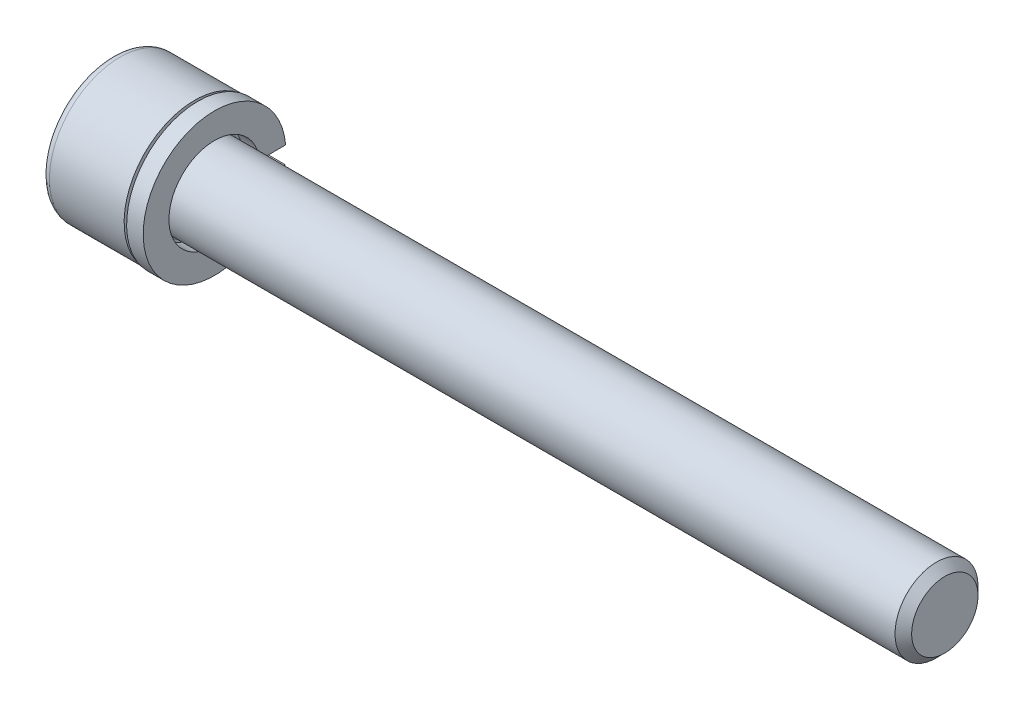
ISO-10303-21;
HEADER;
FILE_DESCRIPTION(('STEP AP214'),'2;1');
FILE_NAME('part.step','',(''),(''),'','','');
FILE_SCHEMA(('AUTOMOTIVE_DESIGN { 1 0 10303 214 1 1 1 1 }'));
ENDSEC;
DATA;
#1=APPLICATION_CONTEXT('core data for automotive mechanical design processes');
#2=APPLICATION_PROTOCOL_DEFINITION('international standard','automotive_design',2000,#1);
#3=PRODUCT_CONTEXT('',#1,'mechanical');
#4=PRODUCT('Part','Part','',(#3));
#5=PRODUCT_RELATED_PRODUCT_CATEGORY('part','',(#4));
#6=PRODUCT_DEFINITION_FORMATION('','',#4);
#7=PRODUCT_DEFINITION_CONTEXT('part definition',#1,'design');
#8=PRODUCT_DEFINITION('design','',#6,#7);
#9=PRODUCT_DEFINITION_SHAPE('','',#8);
#10=(LENGTH_UNIT() NAMED_UNIT(*) SI_UNIT(.MILLI.,.METRE.));
#11=(NAMED_UNIT(*) PLANE_ANGLE_UNIT() SI_UNIT($,.RADIAN.));
#12=(NAMED_UNIT(*) SI_UNIT($,.STERADIAN.) SOLID_ANGLE_UNIT());
#13=UNCERTAINTY_MEASURE_WITH_UNIT(LENGTH_MEASURE(1.E-05),#10,'distance_accuracy_value','');
#14=(GEOMETRIC_REPRESENTATION_CONTEXT(3) GLOBAL_UNCERTAINTY_ASSIGNED_CONTEXT((#13)) GLOBAL_UNIT_ASSIGNED_CONTEXT((#10,
#11,#12)) REPRESENTATION_CONTEXT('',''));
#15=CARTESIAN_POINT('',(0.,0.,0.));
#16=DIRECTION('',(0.,0.,1.));
#17=DIRECTION('',(1.,0.,0.));
#18=AXIS2_PLACEMENT_3D('',#15,#16,#17);
#19=CARTESIAN_POINT('',(1.2,0.,0.));
#20=DIRECTION('',(1.,0.,0.));
#21=DIRECTION('',(0.,1.,0.));
#22=AXIS2_PLACEMENT_3D('',#19,#20,#21);
#23=PLANE('',#22);
#24=CARTESIAN_POINT('',(1.2,0.,0.));
#25=DIRECTION('',(-1.,0.,0.));
#26=DIRECTION('',(0.,-1.,0.));
#27=AXIS2_PLACEMENT_3D('',#24,#25,#26);
#28=CIRCLE('',#27,2.75);
#29=CARTESIAN_POINT('',(1.2,-0.63593269228035,-2.67546063527182));
#30=VERTEX_POINT('',#29);
#31=CARTESIAN_POINT('',(1.2,0.374431043820241,-2.72439009567714));
#32=VERTEX_POINT('',#31);
#33=EDGE_CURVE('P0_E19',#30,#32,#28,.T.);
#34=ORIENTED_EDGE('',*,*,#33,.T.);
#35=DIRECTION('',(0.,0.,1.));
#36=VECTOR('',#35,1.);
#37=CARTESIAN_POINT('',(1.2,0.374431043820241,-2.72439009567714));
#38=LINE('',#37,#36);
#39=CARTESIAN_POINT('',(1.2,0.374431043820242,-4.28366681634131));
#40=VERTEX_POINT('',#39);
#41=EDGE_CURVE('P0_E62',#32,#40,#38,.F.);
#42=ORIENTED_EDGE('',*,*,#41,.T.);
#43=CARTESIAN_POINT('',(1.2,0.,0.));
#44=DIRECTION('',(-1.,0.,0.));
#45=DIRECTION('',(0.,-1.,0.));
#46=AXIS2_PLACEMENT_3D('',#43,#44,#45);
#47=CIRCLE('',#46,4.3);
#48=CARTESIAN_POINT('',(1.2,-0.63593269228035,-4.25271555725152));
#49=VERTEX_POINT('',#48);
#50=EDGE_CURVE('P0_E57',#49,#40,#47,.T.);
#51=ORIENTED_EDGE('',*,*,#50,.F.);
#52=DIRECTION('',(0.,0.,1.));
#53=VECTOR('',#52,1.);
#54=CARTESIAN_POINT('',(1.2,-0.63593269228035,-2.67546063527182));
#55=LINE('',#54,#53);
#56=EDGE_CURVE('P0_E59',#49,#30,#55,.T.);
#57=ORIENTED_EDGE('',*,*,#56,.T.);
#58=EDGE_LOOP('',(#34,#42,#51,#57));
#59=FACE_BOUND('',#58,.T.);
#60=ADVANCED_FACE('P0_F16',(#59),#23,.T.);
#61=CARTESIAN_POINT('',(1.2,-0.63593269228035,-2.67546063527182));
#62=DIRECTION('',(0.,-1.,0.));
#63=DIRECTION('',(1.,0.,0.));
#64=AXIS2_PLACEMENT_3D('',#61,#62,#63);
#65=PLANE('',#64);
#66=DIRECTION('',(-1.,0.,0.));
#67=VECTOR('',#66,1.);
#68=CARTESIAN_POINT('',(1.2,-0.63593269228035,-2.67546063527182));
#69=LINE('',#68,#67);
#70=CARTESIAN_POINT('',(0.2,-0.63593269228035,-2.67546063527182));
#71=VERTEX_POINT('',#70);
#72=EDGE_CURVE('P0_E72',#71,#30,#69,.F.);
#73=ORIENTED_EDGE('',*,*,#72,.T.);
#74=ORIENTED_EDGE('',*,*,#56,.F.);
#75=DIRECTION('',(1.,0.,0.));
#76=VECTOR('',#75,1.);
#77=CARTESIAN_POINT('',(1.2,-0.63593269228035,-4.25271555725152));
#78=LINE('',#77,#76);
#79=CARTESIAN_POINT('',(0.2,-0.63593269228035,-4.25271555725152));
#80=VERTEX_POINT('',#79);
#81=EDGE_CURVE('P0_E71',#80,#49,#78,.T.);
#82=ORIENTED_EDGE('',*,*,#81,.F.);
#83=DIRECTION('',(0.,0.,1.));
#84=VECTOR('',#83,1.);
#85=CARTESIAN_POINT('',(0.2,-0.63593269228035,0.));
#86=LINE('',#85,#84);
#87=EDGE_CURVE('P0_E82',#80,#71,#86,.T.);
#88=ORIENTED_EDGE('',*,*,#87,.T.);
#89=EDGE_LOOP('',(#73,#74,#82,#88));
#90=FACE_BOUND('',#89,.T.);
#91=ADVANCED_FACE('P0_F69',(#90),#65,.F.);
#92=CARTESIAN_POINT('',(1.2,0.,0.));
#93=DIRECTION('',(-1.,0.,0.));
#94=DIRECTION('',(0.,-1.,0.));
#95=AXIS2_PLACEMENT_3D('',#92,#93,#94);
#96=CYLINDRICAL_SURFACE('',#95,2.75);
#97=ORIENTED_EDGE('',*,*,#33,.F.);
#98=ORIENTED_EDGE('',*,*,#72,.F.);
#99=CARTESIAN_POINT('',(0.2,0.,0.));
#100=DIRECTION('',(-1.,0.,0.));
#101=DIRECTION('',(0.,-1.,0.));
#102=AXIS2_PLACEMENT_3D('',#99,#100,#101);
#103=CIRCLE('',#102,2.75);
#104=CARTESIAN_POINT('',(0.2,0.374431043820241,-2.72439009567714));
#105=VERTEX_POINT('',#104);
#106=EDGE_CURVE('P0_E25',#71,#105,#103,.T.);
#107=ORIENTED_EDGE('',*,*,#106,.T.);
#108=DIRECTION('',(-1.,0.,0.));
#109=VECTOR('',#108,1.);
#110=CARTESIAN_POINT('',(1.2,0.374431043820241,-2.72439009567714));
#111=LINE('',#110,#109);
#112=EDGE_CURVE('P0_E79',#105,#32,#111,.F.);
#113=ORIENTED_EDGE('',*,*,#112,.T.);
#114=EDGE_LOOP('',(#97,#98,#107,#113));
#115=FACE_BOUND('',#114,.T.);
#116=ADVANCED_FACE('P0_F90',(#115),#96,.F.);
#117=CARTESIAN_POINT('',(1.2,0.374431043820241,-2.72439009567714));
#118=DIRECTION('',(0.,1.,0.));
#119=DIRECTION('',(-1.,0.,0.));
#120=AXIS2_PLACEMENT_3D('',#117,#118,#119);
#121=PLANE('',#120);
#122=DIRECTION('',(-1.,0.,0.));
#123=VECTOR('',#122,1.);
#124=CARTESIAN_POINT('',(1.2,0.374431043820242,-4.28366681634131));
#125=LINE('',#124,#123);
#126=CARTESIAN_POINT('',(0.2,0.374431043820241,-4.28366681634131));
#127=VERTEX_POINT('',#126);
#128=EDGE_CURVE('P0_E66',#40,#127,#125,.T.);
#129=ORIENTED_EDGE('',*,*,#128,.F.);
#130=ORIENTED_EDGE('',*,*,#41,.F.);
#131=ORIENTED_EDGE('',*,*,#112,.F.);
#132=DIRECTION('',(0.,0.,1.));
#133=VECTOR('',#132,1.);
#134=CARTESIAN_POINT('',(0.2,0.37443104382024,0.));
#135=LINE('',#134,#133);
#136=EDGE_CURVE('P0_E11',#105,#127,#135,.F.);
#137=ORIENTED_EDGE('',*,*,#136,.T.);
#138=EDGE_LOOP('',(#129,#130,#131,#137));
#139=FACE_BOUND('',#138,.T.);
#140=ADVANCED_FACE('P0_F87',(#139),#121,.F.);
#141=CARTESIAN_POINT('',(1.2,0.,0.));
#142=DIRECTION('',(-1.,0.,0.));
#143=DIRECTION('',(0.,-1.,0.));
#144=AXIS2_PLACEMENT_3D('',#141,#142,#143);
#145=CYLINDRICAL_SURFACE('',#144,4.3);
#146=ORIENTED_EDGE('',*,*,#128,.T.);
#147=CARTESIAN_POINT('',(0.2,0.,0.));
#148=DIRECTION('',(-1.,0.,0.));
#149=DIRECTION('',(0.,-1.,0.));
#150=AXIS2_PLACEMENT_3D('',#147,#148,#149);
#151=CIRCLE('',#150,4.3);
#152=EDGE_CURVE('P0_E34',#127,#80,#151,.F.);
#153=ORIENTED_EDGE('',*,*,#152,.T.);
#154=ORIENTED_EDGE('',*,*,#81,.T.);
#155=ORIENTED_EDGE('',*,*,#50,.T.);
#156=EDGE_LOOP('',(#146,#153,#154,#155));
#157=FACE_BOUND('',#156,.T.);
#158=ADVANCED_FACE('P0_F74',(#157),#145,.T.);
#159=CARTESIAN_POINT('',(0.2,0.,0.));
#160=DIRECTION('',(1.,0.,0.));
#161=DIRECTION('',(0.,1.,0.));
#162=AXIS2_PLACEMENT_3D('',#159,#160,#161);
#163=PLANE('',#162);
#164=ORIENTED_EDGE('',*,*,#136,.F.);
#165=ORIENTED_EDGE('',*,*,#106,.F.);
#166=ORIENTED_EDGE('',*,*,#87,.F.);
#167=ORIENTED_EDGE('',*,*,#152,.F.);
#168=EDGE_LOOP('',(#164,#165,#166,#167));
#169=FACE_BOUND('',#168,.T.);
#170=ADVANCED_FACE('P0_F89',(#169),#163,.F.);
#171=CLOSED_SHELL('',(#60,#91,#116,#140,#158,#170));
#172=MANIFOLD_SOLID_BREP('P0_B1',#171);
#173=CARTESIAN_POINT('',(-2.49999999994088,0.,0.));
#174=DIRECTION('',(-1.,0.,0.));
#175=DIRECTION('',(0.,-1.,0.));
#176=AXIS2_PLACEMENT_3D('',#173,#174,#175);
#177=CONICAL_SURFACE('',#176,2.2914999999557,1.04719755113381);
#178=CARTESIAN_POINT('',(-1.17700185805347,-1.70530256582424E-10,0.));
#179=VERTEX_POINT('',#178);
#180=VERTEX_LOOP('',#179);
#181=FACE_BOUND('',#180,.T.);
#182=CARTESIAN_POINT('',(-2.50000000000652,0.,0.));
#183=DIRECTION('',(-1.,0.,0.));
#184=DIRECTION('',(0.,-1.,0.));
#185=AXIS2_PLACEMENT_3D('',#182,#183,#184);
#186=CIRCLE('',#185,2.29150000006939);
#187=CARTESIAN_POINT('',(-2.50000000000652,-1.14575000003469,-1.98449721283214));
#188=VERTEX_POINT('',#187);
#189=CARTESIAN_POINT('',(-2.50000000000652,-2.29150000006939,0.));
#190=VERTEX_POINT('',#189);
#191=EDGE_CURVE('P1_E88',#188,#190,#186,.T.);
#192=ORIENTED_EDGE('',*,*,#191,.T.);
#193=CARTESIAN_POINT('',(-2.49999999994088,0.,0.));
#194=DIRECTION('',(-1.,0.,0.));
#195=DIRECTION('',(0.,-1.,0.));
#196=AXIS2_PLACEMENT_3D('',#193,#194,#195);
#197=CIRCLE('',#196,2.2914999999557);
#198=CARTESIAN_POINT('',(-2.49999999994088,-1.14574999997785,1.98449721273368));
#199=VERTEX_POINT('',#198);
#200=EDGE_CURVE('P1_E83',#190,#199,#197,.T.);
#201=ORIENTED_EDGE('',*,*,#200,.T.);
#202=CARTESIAN_POINT('',(-2.49999999994088,0.,0.));
#203=DIRECTION('',(-1.,0.,0.));
#204=DIRECTION('',(0.,-1.,0.));
#205=AXIS2_PLACEMENT_3D('',#202,#203,#204);
#206=CIRCLE('',#205,2.2914999999557);
#207=CARTESIAN_POINT('',(-2.49999999994088,1.14574999997785,1.98449721273368));
#208=VERTEX_POINT('',#207);
#209=EDGE_CURVE('P1_E85',#199,#208,#206,.T.);
#210=ORIENTED_EDGE('',*,*,#209,.T.);
#211=CARTESIAN_POINT('',(-2.49999999994088,0.,0.));
#212=DIRECTION('',(-1.,0.,0.));
#213=DIRECTION('',(0.,-1.,0.));
#214=AXIS2_PLACEMENT_3D('',#211,#212,#213);
#215=CIRCLE('',#214,2.2914999999557);
#216=CARTESIAN_POINT('',(-2.49999999998408,2.2915000000173,2.46963907657438E-11));
#217=VERTEX_POINT('',#216);
#218=EDGE_CURVE('P1_E99',#208,#217,#215,.T.);
#219=ORIENTED_EDGE('',*,*,#218,.T.);
#220=CARTESIAN_POINT('',(-2.49999999994088,0.,0.));
#221=DIRECTION('',(-1.,0.,0.));
#222=DIRECTION('',(0.,-1.,0.));
#223=AXIS2_PLACEMENT_3D('',#220,#221,#222);
#224=CIRCLE('',#223,2.2914999999557);
#225=CARTESIAN_POINT('',(-2.49999999994088,1.14574999997785,-1.98449721273368));
#226=VERTEX_POINT('',#225);
#227=EDGE_CURVE('P1_E186',#217,#226,#224,.T.);
#228=ORIENTED_EDGE('',*,*,#227,.T.);
#229=CARTESIAN_POINT('',(-2.49999999994088,0.,0.));
#230=DIRECTION('',(-1.,0.,0.));
#231=DIRECTION('',(0.,-1.,0.));
#232=AXIS2_PLACEMENT_3D('',#229,#230,#231);
#233=CIRCLE('',#232,2.2914999999557);
#234=EDGE_CURVE('P1_E184',#226,#188,#233,.T.);
#235=ORIENTED_EDGE('',*,*,#234,.T.);
#236=EDGE_LOOP('',(#192,#201,#210,#219,#228,#235));
#237=FACE_BOUND('',#236,.T.);
#238=ADVANCED_FACE('P1_F16',(#181,#237),#177,.F.);
#239=CARTESIAN_POINT('',(-2.5,0.,0.));
#240=DIRECTION('',(-1.,0.,0.));
#241=DIRECTION('',(0.,-1.,0.));
#242=AXIS2_PLACEMENT_3D('',#239,#240,#241);
#243=PLANE('',#242);
#244=ORIENTED_EDGE('',*,*,#209,.F.);
#245=DIRECTION('',(0.,-1.,0.));
#246=VECTOR('',#245,1.);
#247=CARTESIAN_POINT('',(-2.5,-1.14575,1.98449721277204));
#248=LINE('',#247,#246);
#249=EDGE_CURVE('P1_E93',#199,#208,#248,.F.);
#250=ORIENTED_EDGE('',*,*,#249,.T.);
#251=EDGE_LOOP('',(#244,#250));
#252=FACE_BOUND('',#251,.T.);
#253=ADVANCED_FACE('P1_F96',(#252),#243,.F.);
#254=CARTESIAN_POINT('',(-2.5,0.,0.));
#255=DIRECTION('',(-1.,0.,0.));
#256=DIRECTION('',(0.,-1.,0.));
#257=AXIS2_PLACEMENT_3D('',#254,#255,#256);
#258=PLANE('',#257);
#259=ORIENTED_EDGE('',*,*,#218,.F.);
#260=DIRECTION('',(0.,-0.5,0.866025403784439));
#261=VECTOR('',#260,1.);
#262=CARTESIAN_POINT('',(-2.5,1.14575,1.98449721277204));
#263=LINE('',#262,#261);
#264=EDGE_CURVE('P1_E162',#208,#217,#263,.F.);
#265=ORIENTED_EDGE('',*,*,#264,.T.);
#266=EDGE_LOOP('',(#259,#265));
#267=FACE_BOUND('',#266,.T.);
#268=ADVANCED_FACE('P1_F293',(#267),#258,.F.);
#269=CARTESIAN_POINT('',(-2.5,0.,0.));
#270=DIRECTION('',(-1.,0.,0.));
#271=DIRECTION('',(0.,-1.,0.));
#272=AXIS2_PLACEMENT_3D('',#269,#270,#271);
#273=PLANE('',#272);
#274=ORIENTED_EDGE('',*,*,#227,.F.);
#275=DIRECTION('',(0.,0.5,0.866025403784439));
#276=VECTOR('',#275,1.);
#277=CARTESIAN_POINT('',(-2.5,2.2915,0.));
#278=LINE('',#277,#276);
#279=EDGE_CURVE('P1_E151',#217,#226,#278,.F.);
#280=ORIENTED_EDGE('',*,*,#279,.T.);
#281=EDGE_LOOP('',(#274,#280));
#282=FACE_BOUND('',#281,.T.);
#283=ADVANCED_FACE('P1_F297',(#282),#273,.F.);
#284=CARTESIAN_POINT('',(-2.5,0.,0.));
#285=DIRECTION('',(-1.,0.,0.));
#286=DIRECTION('',(0.,-1.,0.));
#287=AXIS2_PLACEMENT_3D('',#284,#285,#286);
#288=PLANE('',#287);
#289=ORIENTED_EDGE('',*,*,#234,.F.);
#290=DIRECTION('',(0.,1.,0.));
#291=VECTOR('',#290,1.);
#292=CARTESIAN_POINT('',(-2.5,1.14575,-1.98449721277205));
#293=LINE('',#292,#291);
#294=EDGE_CURVE('P1_E139',#226,#188,#293,.F.);
#295=ORIENTED_EDGE('',*,*,#294,.T.);
#296=EDGE_LOOP('',(#289,#295));
#297=FACE_BOUND('',#296,.T.);
#298=ADVANCED_FACE('P1_F304',(#297),#288,.F.);
#299=CARTESIAN_POINT('',(-2.5,0.,0.));
#300=DIRECTION('',(-1.,0.,0.));
#301=DIRECTION('',(0.,-1.,0.));
#302=AXIS2_PLACEMENT_3D('',#299,#300,#301);
#303=PLANE('',#302);
#304=ORIENTED_EDGE('',*,*,#191,.F.);
#305=DIRECTION('',(0.,0.5,-0.866025403784438));
#306=VECTOR('',#305,1.);
#307=CARTESIAN_POINT('',(-2.5,-1.14575,-1.98449721277204));
#308=LINE('',#307,#306);
#309=EDGE_CURVE('P1_E125',#188,#190,#308,.F.);
#310=ORIENTED_EDGE('',*,*,#309,.T.);
#311=EDGE_LOOP('',(#304,#310));
#312=FACE_BOUND('',#311,.T.);
#313=ADVANCED_FACE('P1_F307',(#312),#303,.F.);
#314=CARTESIAN_POINT('',(-2.5,0.,0.));
#315=DIRECTION('',(-1.,0.,0.));
#316=DIRECTION('',(0.,-1.,0.));
#317=AXIS2_PLACEMENT_3D('',#314,#315,#316);
#318=PLANE('',#317);
#319=ORIENTED_EDGE('',*,*,#200,.F.);
#320=DIRECTION('',(0.,-0.5,-0.866025403784438));
#321=VECTOR('',#320,1.);
#322=CARTESIAN_POINT('',(-2.5,-2.2915,0.));
#323=LINE('',#322,#321);
#324=EDGE_CURVE('P1_E101',#190,#199,#323,.F.);
#325=ORIENTED_EDGE('',*,*,#324,.T.);
#326=EDGE_LOOP('',(#319,#325));
#327=FACE_BOUND('',#326,.T.);
#328=ADVANCED_FACE('P1_F102',(#327),#318,.F.);
#329=CARTESIAN_POINT('',(-2.5,-1.14575,1.98449721277204));
#330=DIRECTION('',(0.,0.,1.));
#331=DIRECTION('',(0.,-1.,0.));
#332=AXIS2_PLACEMENT_3D('',#329,#330,#331);
#333=PLANE('',#332);
#334=DIRECTION('',(1.,0.,0.));
#335=VECTOR('',#334,1.);
#336=CARTESIAN_POINT('',(-2.5,1.14575,1.98449721277204));
#337=LINE('',#336,#335);
#338=CARTESIAN_POINT('',(-5.,1.14575,1.98449721277204));
#339=VERTEX_POINT('',#338);
#340=EDGE_CURVE('P1_E113',#339,#208,#337,.T.);
#341=ORIENTED_EDGE('',*,*,#340,.T.);
#342=ORIENTED_EDGE('',*,*,#249,.F.);
#343=DIRECTION('',(1.,0.,0.));
#344=VECTOR('',#343,1.);
#345=CARTESIAN_POINT('',(-2.5,-1.14575,1.98449721277204));
#346=LINE('',#345,#344);
#347=CARTESIAN_POINT('',(-5.,-1.14575,1.98449721277204));
#348=VERTEX_POINT('',#347);
#349=EDGE_CURVE('P1_E106',#199,#348,#346,.F.);
#350=ORIENTED_EDGE('',*,*,#349,.T.);
#351=DIRECTION('',(0.,1.,0.));
#352=VECTOR('',#351,1.);
#353=CARTESIAN_POINT('',(-5.,2.2915,1.98449721277204));
#354=LINE('',#353,#352);
#355=EDGE_CURVE('P1_E120',#348,#339,#354,.T.);
#356=ORIENTED_EDGE('',*,*,#355,.T.);
#357=EDGE_LOOP('',(#341,#342,#350,#356));
#358=FACE_BOUND('',#357,.T.);
#359=ADVANCED_FACE('P1_F110',(#358),#333,.F.);
#360=CARTESIAN_POINT('',(-2.5,1.14575,1.98449721277204));
#361=DIRECTION('',(0.,0.866025403784439,0.5));
#362=DIRECTION('',(0.,-0.5,0.866025403784439));
#363=AXIS2_PLACEMENT_3D('',#360,#361,#362);
#364=PLANE('',#363);
#365=DIRECTION('',(1.,0.,0.));
#366=VECTOR('',#365,1.);
#367=CARTESIAN_POINT('',(-2.5,2.2915,0.));
#368=LINE('',#367,#366);
#369=CARTESIAN_POINT('',(-5.,2.2915,0.));
#370=VERTEX_POINT('',#369);
#371=EDGE_CURVE('P1_E156',#370,#217,#368,.T.);
#372=ORIENTED_EDGE('',*,*,#371,.T.);
#373=ORIENTED_EDGE('',*,*,#264,.F.);
#374=ORIENTED_EDGE('',*,*,#340,.F.);
#375=DIRECTION('',(0.,0.500000000000001,-0.866025403784438));
#376=VECTOR('',#375,1.);
#377=CARTESIAN_POINT('',(-5.,1.14575,1.98449721277204));
#378=LINE('',#377,#376);
#379=EDGE_CURVE('P1_E122',#339,#370,#378,.T.);
#380=ORIENTED_EDGE('',*,*,#379,.T.);
#381=EDGE_LOOP('',(#372,#373,#374,#380));
#382=FACE_BOUND('',#381,.T.);
#383=ADVANCED_FACE('P1_F289',(#382),#364,.F.);
#384=CARTESIAN_POINT('',(-2.5,2.2915,0.));
#385=DIRECTION('',(0.,0.866025403784439,-0.5));
#386=DIRECTION('',(0.,0.5,0.866025403784439));
#387=AXIS2_PLACEMENT_3D('',#384,#385,#386);
#388=PLANE('',#387);
#389=DIRECTION('',(1.,0.,0.));
#390=VECTOR('',#389,1.);
#391=CARTESIAN_POINT('',(-2.5,1.14575,-1.98449721277205));
#392=LINE('',#391,#390);
#393=CARTESIAN_POINT('',(-5.,1.14575,-1.98449721277204));
#394=VERTEX_POINT('',#393);
#395=EDGE_CURVE('P1_E144',#394,#226,#392,.T.);
#396=ORIENTED_EDGE('',*,*,#395,.T.);
#397=ORIENTED_EDGE('',*,*,#279,.F.);
#398=ORIENTED_EDGE('',*,*,#371,.F.);
#399=DIRECTION('',(0.,-0.5,-0.866025403784439));
#400=VECTOR('',#399,1.);
#401=CARTESIAN_POINT('',(-5.,2.2915,0.));
#402=LINE('',#401,#400);
#403=EDGE_CURVE('P1_E146',#370,#394,#402,.T.);
#404=ORIENTED_EDGE('',*,*,#403,.T.);
#405=EDGE_LOOP('',(#396,#397,#398,#404));
#406=FACE_BOUND('',#405,.T.);
#407=ADVANCED_FACE('P1_F300',(#406),#388,.F.);
#408=CARTESIAN_POINT('',(-2.5,1.14575,-1.98449721277205));
#409=DIRECTION('',(0.,0.,-1.));
#410=DIRECTION('',(0.,1.,0.));
#411=AXIS2_PLACEMENT_3D('',#408,#409,#410);
#412=PLANE('',#411);
#413=DIRECTION('',(1.,0.,0.));
#414=VECTOR('',#413,1.);
#415=CARTESIAN_POINT('',(-2.5,-1.14575,-1.98449721277204));
#416=LINE('',#415,#414);
#417=CARTESIAN_POINT('',(-5.,-1.14575,-1.98449721277204));
#418=VERTEX_POINT('',#417);
#419=EDGE_CURVE('P1_E127',#418,#188,#416,.T.);
#420=ORIENTED_EDGE('',*,*,#419,.T.);
#421=ORIENTED_EDGE('',*,*,#294,.F.);
#422=ORIENTED_EDGE('',*,*,#395,.F.);
#423=DIRECTION('',(0.,1.,0.));
#424=VECTOR('',#423,1.);
#425=CARTESIAN_POINT('',(-5.,2.2915,-1.98449721277204));
#426=LINE('',#425,#424);
#427=EDGE_CURVE('P1_E130',#394,#418,#426,.F.);
#428=ORIENTED_EDGE('',*,*,#427,.T.);
#429=EDGE_LOOP('',(#420,#421,#422,#428));
#430=FACE_BOUND('',#429,.T.);
#431=ADVANCED_FACE('P1_F305',(#430),#412,.F.);
#432=CARTESIAN_POINT('',(-2.5,-1.14575,-1.98449721277204));
#433=DIRECTION('',(0.,-0.866025403784438,-0.5));
#434=DIRECTION('',(0.,0.5,-0.866025403784438));
#435=AXIS2_PLACEMENT_3D('',#432,#433,#434);
#436=PLANE('',#435);
#437=DIRECTION('',(1.,0.,0.));
#438=VECTOR('',#437,1.);
#439=CARTESIAN_POINT('',(-2.5,-2.2915,0.));
#440=LINE('',#439,#438);
#441=CARTESIAN_POINT('',(-5.,-2.2915,0.));
#442=VERTEX_POINT('',#441);
#443=EDGE_CURVE('P1_E107',#442,#190,#440,.T.);
#444=ORIENTED_EDGE('',*,*,#443,.T.);
#445=ORIENTED_EDGE('',*,*,#309,.F.);
#446=ORIENTED_EDGE('',*,*,#419,.F.);
#447=DIRECTION('',(0.,-0.5,0.866025403784439));
#448=VECTOR('',#447,1.);
#449=CARTESIAN_POINT('',(-5.,-1.14575,-1.98449721277204));
#450=LINE('',#449,#448);
#451=EDGE_CURVE('P1_E128',#418,#442,#450,.T.);
#452=ORIENTED_EDGE('',*,*,#451,.T.);
#453=EDGE_LOOP('',(#444,#445,#446,#452));
#454=FACE_BOUND('',#453,.T.);
#455=ADVANCED_FACE('P1_F280',(#454),#436,.F.);
#456=CARTESIAN_POINT('',(-2.5,-2.2915,0.));
#457=DIRECTION('',(0.,-0.866025403784438,0.5));
#458=DIRECTION('',(0.,-0.5,-0.866025403784438));
#459=AXIS2_PLACEMENT_3D('',#456,#457,#458);
#460=PLANE('',#459);
#461=ORIENTED_EDGE('',*,*,#349,.F.);
#462=ORIENTED_EDGE('',*,*,#324,.F.);
#463=ORIENTED_EDGE('',*,*,#443,.F.);
#464=DIRECTION('',(0.,0.5,0.866025403784439));
#465=VECTOR('',#464,1.);
#466=CARTESIAN_POINT('',(-5.,-2.2915,0.));
#467=LINE('',#466,#465);
#468=EDGE_CURVE('P1_E118',#442,#348,#467,.T.);
#469=ORIENTED_EDGE('',*,*,#468,.T.);
#470=EDGE_LOOP('',(#461,#462,#463,#469));
#471=FACE_BOUND('',#470,.T.);
#472=ADVANCED_FACE('P1_F116',(#471),#460,.F.);
#473=CARTESIAN_POINT('',(-5.,2.2915,0.));
#474=DIRECTION('',(1.,0.,0.));
#475=DIRECTION('',(0.,1.,0.));
#476=AXIS2_PLACEMENT_3D('',#473,#474,#475);
#477=PLANE('',#476);
#478=CARTESIAN_POINT('',(-5.,0.,0.));
#479=DIRECTION('',(1.,0.,0.));
#480=DIRECTION('',(0.,-1.,0.));
#481=AXIS2_PLACEMENT_3D('',#478,#479,#480);
#482=CIRCLE('',#481,3.75);
#483=CARTESIAN_POINT('',(-5.,-3.75,0.));
#484=VERTEX_POINT('',#483);
#485=CARTESIAN_POINT('',(-5.,3.75,0.));
#486=VERTEX_POINT('',#485);
#487=EDGE_CURVE('P1_E134',#484,#486,#482,.T.);
#488=ORIENTED_EDGE('',*,*,#487,.F.);
#489=CARTESIAN_POINT('',(-5.,0.,0.));
#490=DIRECTION('',(1.,0.,0.));
#491=DIRECTION('',(0.,1.,0.));
#492=AXIS2_PLACEMENT_3D('',#489,#490,#491);
#493=CIRCLE('',#492,3.75);
#494=EDGE_CURVE('P1_E249',#486,#484,#493,.T.);
#495=ORIENTED_EDGE('',*,*,#494,.F.);
#496=EDGE_LOOP('',(#488,#495));
#497=FACE_BOUND('',#496,.T.);
#498=ORIENTED_EDGE('',*,*,#451,.F.);
#499=ORIENTED_EDGE('',*,*,#427,.F.);
#500=ORIENTED_EDGE('',*,*,#403,.F.);
#501=ORIENTED_EDGE('',*,*,#379,.F.);
#502=ORIENTED_EDGE('',*,*,#355,.F.);
#503=ORIENTED_EDGE('',*,*,#468,.F.);
#504=EDGE_LOOP('',(#498,#499,#500,#501,#502,#503));
#505=FACE_BOUND('',#504,.T.);
#506=ADVANCED_FACE('P1_F258',(#497,#505),#477,.F.);
#507=CARTESIAN_POINT('',(-4.5,0.,0.));
#508=DIRECTION('',(-1.,0.,0.));
#509=DIRECTION('',(0.,1.,0.));
#510=AXIS2_PLACEMENT_3D('',#507,#508,#509);
#511=TOROIDAL_SURFACE('',#510,3.75,0.5);
#512=ORIENTED_EDGE('',*,*,#487,.T.);
#513=ORIENTED_EDGE('',*,*,#494,.T.);
#514=EDGE_LOOP('',(#512,#513));
#515=FACE_BOUND('',#514,.T.);
#516=CARTESIAN_POINT('',(-4.5,0.,0.));
#517=DIRECTION('',(-1.,0.,0.));
#518=DIRECTION('',(0.,-1.,0.));
#519=AXIS2_PLACEMENT_3D('',#516,#517,#518);
#520=CIRCLE('',#519,4.25);
#521=CARTESIAN_POINT('',(-4.5,-4.25,0.));
#522=VERTEX_POINT('',#521);
#523=EDGE_CURVE('P1_E181',#522,#522,#520,.F.);
#524=ORIENTED_EDGE('',*,*,#523,.F.);
#525=EDGE_LOOP('',(#524));
#526=FACE_BOUND('',#525,.T.);
#527=ADVANCED_FACE('P1_F253',(#515,#526),#511,.T.);
#528=CARTESIAN_POINT('',(-1.17700185815197,0.,0.));
#529=DIRECTION('',(-1.,0.,0.));
#530=DIRECTION('',(0.,-1.,0.));
#531=AXIS2_PLACEMENT_3D('',#528,#529,#530);
#532=CYLINDRICAL_SURFACE('',#531,4.25);
#533=ORIENTED_EDGE('',*,*,#523,.T.);
#534=EDGE_LOOP('',(#533));
#535=FACE_BOUND('',#534,.T.);
#536=CARTESIAN_POINT('',(0.,0.,0.));
#537=DIRECTION('',(-1.,0.,0.));
#538=DIRECTION('',(0.,-1.,0.));
#539=AXIS2_PLACEMENT_3D('',#536,#537,#538);
#540=CIRCLE('',#539,4.25);
#541=CARTESIAN_POINT('',(0.,-4.25,0.));
#542=VERTEX_POINT('',#541);
#543=EDGE_CURVE('P1_E179',#542,#542,#540,.T.);
#544=ORIENTED_EDGE('',*,*,#543,.T.);
#545=EDGE_LOOP('',(#544));
#546=FACE_BOUND('',#545,.T.);
#547=ADVANCED_FACE('P1_F257',(#535,#546),#532,.T.);
#548=CARTESIAN_POINT('',(45.2,0.,0.));
#549=DIRECTION('',(-1.,0.,0.));
#550=DIRECTION('',(0.,0.,1.));
#551=AXIS2_PLACEMENT_3D('',#548,#549,#550);
#552=PLANE('',#551);
#553=CARTESIAN_POINT('',(45.2000000000226,0.,0.));
#554=DIRECTION('',(-1.,0.,0.));
#555=DIRECTION('',(0.,0.,1.));
#556=AXIS2_PLACEMENT_3D('',#553,#554,#555);
#557=CIRCLE('',#556,1.99999999995271);
#558=CARTESIAN_POINT('',(45.2000000000226,0.,1.99999999995271));
#559=VERTEX_POINT('',#558);
#560=EDGE_CURVE('P1_E175',#559,#559,#557,.T.);
#561=ORIENTED_EDGE('',*,*,#560,.F.);
#562=EDGE_LOOP('',(#561));
#563=FACE_BOUND('',#562,.T.);
#564=ADVANCED_FACE('P1_F226',(#563),#552,.F.);
#565=CARTESIAN_POINT('',(0.,4.25,0.));
#566=DIRECTION('',(-1.,0.,0.));
#567=DIRECTION('',(0.,-1.,0.));
#568=AXIS2_PLACEMENT_3D('',#565,#566,#567);
#569=PLANE('',#568);
#570=CARTESIAN_POINT('',(0.,0.,0.));
#571=DIRECTION('',(1.,0.,0.));
#572=DIRECTION('',(0.,-1.,0.));
#573=AXIS2_PLACEMENT_3D('',#570,#571,#572);
#574=CIRCLE('',#573,2.7);
#575=CARTESIAN_POINT('',(0.,2.7,0.));
#576=VERTEX_POINT('',#575);
#577=CARTESIAN_POINT('',(0.,-2.7,0.));
#578=VERTEX_POINT('',#577);
#579=EDGE_CURVE('P1_E178',#576,#578,#574,.F.);
#580=ORIENTED_EDGE('',*,*,#579,.T.);
#581=CARTESIAN_POINT('',(0.,0.,0.));
#582=DIRECTION('',(1.,0.,0.));
#583=DIRECTION('',(0.,1.,0.));
#584=AXIS2_PLACEMENT_3D('',#581,#582,#583);
#585=CIRCLE('',#584,2.7);
#586=EDGE_CURVE('P1_E35',#578,#576,#585,.F.);
#587=ORIENTED_EDGE('',*,*,#586,.T.);
#588=EDGE_LOOP('',(#580,#587));
#589=FACE_BOUND('',#588,.T.);
#590=ORIENTED_EDGE('',*,*,#543,.F.);
#591=EDGE_LOOP('',(#590));
#592=FACE_BOUND('',#591,.T.);
#593=ADVANCED_FACE('P1_F217',(#589,#592),#569,.F.);
#594=CARTESIAN_POINT('',(44.7000000000912,0.,0.));
#595=DIRECTION('',(-1.,0.,0.));
#596=DIRECTION('',(0.,0.,1.));
#597=AXIS2_PLACEMENT_3D('',#594,#595,#596);
#598=CONICAL_SURFACE('',#597,2.49999999988404,0.785398163397448);
#599=ORIENTED_EDGE('',*,*,#560,.T.);
#600=EDGE_LOOP('',(#599));
#601=FACE_BOUND('',#600,.T.);
#602=CARTESIAN_POINT('',(44.7,0.,0.));
#603=DIRECTION('',(-1.,0.,0.));
#604=DIRECTION('',(0.,-1.,0.));
#605=AXIS2_PLACEMENT_3D('',#602,#603,#604);
#606=CIRCLE('',#605,2.5);
#607=CARTESIAN_POINT('',(44.7,-2.5,0.));
#608=VERTEX_POINT('',#607);
#609=EDGE_CURVE('P1_E27',#608,#608,#606,.T.);
#610=ORIENTED_EDGE('',*,*,#609,.F.);
#611=EDGE_LOOP('',(#610));
#612=FACE_BOUND('',#611,.T.);
#613=ADVANCED_FACE('P1_F206',(#601,#612),#598,.T.);
#614=CARTESIAN_POINT('',(0.200000000000003,0.,0.));
#615=DIRECTION('',(-1.,0.,0.));
#616=DIRECTION('',(0.,1.,0.));
#617=AXIS2_PLACEMENT_3D('',#614,#615,#616);
#618=TOROIDAL_SURFACE('',#617,2.7,0.2);
#619=CARTESIAN_POINT('',(0.200000000000002,0.,0.));
#620=DIRECTION('',(-1.,0.,0.));
#621=DIRECTION('',(0.,-1.,0.));
#622=AXIS2_PLACEMENT_3D('',#619,#620,#621);
#623=CIRCLE('',#622,2.5);
#624=CARTESIAN_POINT('',(0.200000000000002,-2.5,0.));
#625=VERTEX_POINT('',#624);
#626=EDGE_CURVE('P1_E11',#625,#625,#623,.F.);
#627=ORIENTED_EDGE('',*,*,#626,.F.);
#628=EDGE_LOOP('',(#627));
#629=FACE_BOUND('',#628,.T.);
#630=ORIENTED_EDGE('',*,*,#579,.F.);
#631=ORIENTED_EDGE('',*,*,#586,.F.);
#632=EDGE_LOOP('',(#630,#631));
#633=FACE_BOUND('',#632,.T.);
#634=ADVANCED_FACE('P1_F194',(#629,#633),#618,.F.);
#635=CARTESIAN_POINT('',(-1.17700185815197,0.,0.));
#636=DIRECTION('',(-1.,0.,0.));
#637=DIRECTION('',(0.,-1.,0.));
#638=AXIS2_PLACEMENT_3D('',#635,#636,#637);
#639=CYLINDRICAL_SURFACE('',#638,2.5);
#640=ORIENTED_EDGE('',*,*,#626,.T.);
#641=EDGE_LOOP('',(#640));
#642=FACE_BOUND('',#641,.T.);
#643=ORIENTED_EDGE('',*,*,#609,.T.);
#644=EDGE_LOOP('',(#643));
#645=FACE_BOUND('',#644,.T.);
#646=ADVANCED_FACE('P1_F205',(#642,#645),#639,.T.);
#647=CLOSED_SHELL('',(#238,#253,#268,#283,#298,#313,#328,#359,#383,#407,#431,#455,#472,#506,
#527,#547,#564,#593,#613,#634,#646));
#648=MANIFOLD_SOLID_BREP('P1_B1',#647);
#649=ADVANCED_BREP_SHAPE_REPRESENTATION('',(#18,#172,#648),#14);
#650=SHAPE_DEFINITION_REPRESENTATION(#9,#649);
ENDSEC;
END-ISO-10303-21;
